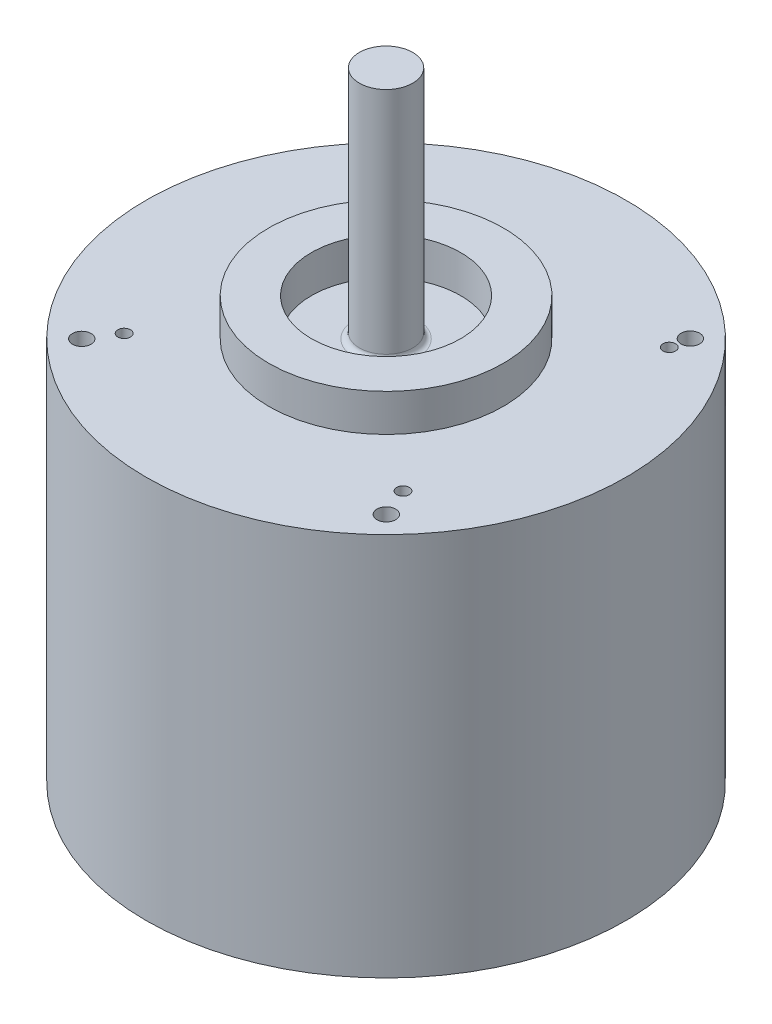
ISO-10303-21;
HEADER;
FILE_DESCRIPTION(('STEP AP214'),'2;1');
FILE_NAME('part.step','',(''),(''),'','','');
FILE_SCHEMA(('AUTOMOTIVE_DESIGN { 1 0 10303 214 1 1 1 1 }'));
ENDSEC;
DATA;
#1=APPLICATION_CONTEXT('core data for automotive mechanical design processes');
#2=APPLICATION_PROTOCOL_DEFINITION('international standard','automotive_design',2000,#1);
#3=PRODUCT_CONTEXT('',#1,'mechanical');
#4=PRODUCT('Part','Part','',(#3));
#5=PRODUCT_RELATED_PRODUCT_CATEGORY('part','',(#4));
#6=PRODUCT_DEFINITION_FORMATION('','',#4);
#7=PRODUCT_DEFINITION_CONTEXT('part definition',#1,'design');
#8=PRODUCT_DEFINITION('design','',#6,#7);
#9=PRODUCT_DEFINITION_SHAPE('','',#8);
#10=(LENGTH_UNIT() NAMED_UNIT(*) SI_UNIT(.MILLI.,.METRE.));
#11=(NAMED_UNIT(*) PLANE_ANGLE_UNIT() SI_UNIT($,.RADIAN.));
#12=(NAMED_UNIT(*) SI_UNIT($,.STERADIAN.) SOLID_ANGLE_UNIT());
#13=UNCERTAINTY_MEASURE_WITH_UNIT(LENGTH_MEASURE(1.E-05),#10,'distance_accuracy_value','');
#14=(GEOMETRIC_REPRESENTATION_CONTEXT(3) GLOBAL_UNCERTAINTY_ASSIGNED_CONTEXT((#13)) GLOBAL_UNIT_ASSIGNED_CONTEXT((#10,
#11,#12)) REPRESENTATION_CONTEXT('',''));
#15=CARTESIAN_POINT('',(0.,0.,0.));
#16=DIRECTION('',(0.,0.,1.));
#17=DIRECTION('',(1.,0.,0.));
#18=AXIS2_PLACEMENT_3D('',#15,#16,#17);
#19=CARTESIAN_POINT('',(0.,0.,0.));
#20=DIRECTION('',(0.,1.,0.));
#21=DIRECTION('',(0.,0.,1.));
#22=AXIS2_PLACEMENT_3D('',#19,#20,#21);
#23=PLANE('',#22);
#24=CARTESIAN_POINT('',(0.,0.,-11.5));
#25=DIRECTION('',(0.,1.,0.));
#26=DIRECTION('',(0.,0.,1.));
#27=AXIS2_PLACEMENT_3D('',#24,#25,#26);
#28=CIRCLE('',#27,2.5);
#29=CARTESIAN_POINT('',(0.,0.,-9.));
#30=VERTEX_POINT('',#29);
#31=EDGE_CURVE('E304',#30,#30,#28,.T.);
#32=ORIENTED_EDGE('',*,*,#31,.T.);
#33=EDGE_LOOP('',(#32));
#34=FACE_BOUND('',#33,.T.);
#35=CARTESIAN_POINT('',(0.,0.,0.));
#36=DIRECTION('',(0.,1.,0.));
#37=DIRECTION('',(0.,0.,1.));
#38=AXIS2_PLACEMENT_3D('',#35,#36,#37);
#39=CIRCLE('',#38,22.5);
#40=CARTESIAN_POINT('',(0.,0.,22.5));
#41=VERTEX_POINT('',#40);
#42=EDGE_CURVE('E143',#41,#41,#39,.T.);
#43=ORIENTED_EDGE('',*,*,#42,.F.);
#44=EDGE_LOOP('',(#43));
#45=FACE_BOUND('',#44,.T.);
#46=ADVANCED_FACE('F35',(#34,#45),#23,.F.);
#47=CARTESIAN_POINT('',(0.,36.,0.));
#48=DIRECTION('',(0.,1.,0.));
#49=DIRECTION('',(0.,0.,1.));
#50=AXIS2_PLACEMENT_3D('',#47,#48,#49);
#51=PLANE('',#50);
#52=CARTESIAN_POINT('',(0.,36.,0.));
#53=DIRECTION('',(0.,1.,0.));
#54=DIRECTION('',(0.,0.,1.));
#55=AXIS2_PLACEMENT_3D('',#52,#53,#54);
#56=CIRCLE('',#55,3.);
#57=CARTESIAN_POINT('',(0.,36.,3.));
#58=VERTEX_POINT('',#57);
#59=EDGE_CURVE('E43',#58,#58,#56,.F.);
#60=ORIENTED_EDGE('',*,*,#59,.T.);
#61=EDGE_LOOP('',(#60));
#62=FACE_BOUND('',#61,.T.);
#63=CARTESIAN_POINT('',(0.,36.,0.));
#64=DIRECTION('',(0.,1.,0.));
#65=DIRECTION('',(0.,0.,1.));
#66=AXIS2_PLACEMENT_3D('',#63,#64,#65);
#67=CIRCLE('',#66,7.);
#68=CARTESIAN_POINT('',(0.,36.,7.));
#69=VERTEX_POINT('',#68);
#70=EDGE_CURVE('E134',#69,#69,#67,.T.);
#71=ORIENTED_EDGE('',*,*,#70,.T.);
#72=EDGE_LOOP('',(#71));
#73=FACE_BOUND('',#72,.T.);
#74=ADVANCED_FACE('F156',(#62,#73),#51,.T.);
#75=CARTESIAN_POINT('',(0.,36.,0.));
#76=DIRECTION('',(0.,1.,0.));
#77=DIRECTION('',(0.,0.,1.));
#78=AXIS2_PLACEMENT_3D('',#75,#76,#77);
#79=PLANE('',#78);
#80=CARTESIAN_POINT('',(-13.163543755973,36.,-12.0287555011478));
#81=DIRECTION('',(0.,1.,0.));
#82=DIRECTION('',(0.,0.,1.));
#83=AXIS2_PLACEMENT_3D('',#80,#81,#82);
#84=CIRCLE('',#83,0.595629999999989);
#85=CARTESIAN_POINT('',(-13.163543755973,36.,-11.4331255011478));
#86=VERTEX_POINT('',#85);
#87=EDGE_CURVE('E79',#86,#86,#84,.T.);
#88=ORIENTED_EDGE('',*,*,#87,.F.);
#89=EDGE_LOOP('',(#88));
#90=FACE_BOUND('',#89,.T.);
#91=CARTESIAN_POINT('',(13.163543755973,36.,11.5748401992176));
#92=DIRECTION('',(0.,1.,0.));
#93=DIRECTION('',(0.,0.,1.));
#94=AXIS2_PLACEMENT_3D('',#91,#92,#93);
#95=CIRCLE('',#94,0.595629999999989);
#96=CARTESIAN_POINT('',(13.163543755973,36.,12.1704701992176));
#97=VERTEX_POINT('',#96);
#98=EDGE_CURVE('E78',#97,#97,#95,.T.);
#99=ORIENTED_EDGE('',*,*,#98,.F.);
#100=EDGE_LOOP('',(#99));
#101=FACE_BOUND('',#100,.T.);
#102=CARTESIAN_POINT('',(13.9805912994472,36.,-12.5734538634639));
#103=DIRECTION('',(0.,1.,0.));
#104=DIRECTION('',(0.,0.,1.));
#105=AXIS2_PLACEMENT_3D('',#102,#103,#104);
#106=CIRCLE('',#105,0.595629999999989);
#107=CARTESIAN_POINT('',(13.9805912994472,36.,-11.9778238634639));
#108=VERTEX_POINT('',#107);
#109=EDGE_CURVE('E91',#108,#108,#106,.T.);
#110=ORIENTED_EDGE('',*,*,#109,.F.);
#111=EDGE_LOOP('',(#110));
#112=FACE_BOUND('',#111,.T.);
#113=CARTESIAN_POINT('',(-12.7096284540429,36.,11.8471893803757));
#114=DIRECTION('',(0.,1.,0.));
#115=DIRECTION('',(0.,0.,1.));
#116=AXIS2_PLACEMENT_3D('',#113,#114,#115);
#117=CIRCLE('',#116,0.595629999999989);
#118=CARTESIAN_POINT('',(-12.7096284540429,36.,12.4428193803756));
#119=VERTEX_POINT('',#118);
#120=EDGE_CURVE('E97',#119,#119,#117,.T.);
#121=ORIENTED_EDGE('',*,*,#120,.F.);
#122=EDGE_LOOP('',(#121));
#123=FACE_BOUND('',#122,.T.);
#124=CARTESIAN_POINT('',(-14.2766530159782,36.,-14.2534216308251));
#125=DIRECTION('',(0.,1.,0.));
#126=DIRECTION('',(0.,0.,1.));
#127=AXIS2_PLACEMENT_3D('',#124,#125,#126);
#128=CIRCLE('',#127,0.874999999999989);
#129=CARTESIAN_POINT('',(-14.2766530159782,36.,-13.3784216308251));
#130=VERTEX_POINT('',#129);
#131=EDGE_CURVE('E106',#130,#130,#128,.T.);
#132=ORIENTED_EDGE('',*,*,#131,.F.);
#133=EDGE_LOOP('',(#132));
#134=FACE_BOUND('',#133,.T.);
#135=CARTESIAN_POINT('',(14.2534216308251,36.,-14.2766530159782));
#136=DIRECTION('',(0.,1.,0.));
#137=DIRECTION('',(0.,0.,1.));
#138=AXIS2_PLACEMENT_3D('',#135,#136,#137);
#139=CIRCLE('',#138,0.874999999999989);
#140=CARTESIAN_POINT('',(14.2534216308251,36.,-13.4016530159782));
#141=VERTEX_POINT('',#140);
#142=EDGE_CURVE('E112',#141,#141,#139,.T.);
#143=ORIENTED_EDGE('',*,*,#142,.F.);
#144=EDGE_LOOP('',(#143));
#145=FACE_BOUND('',#144,.T.);
#146=CARTESIAN_POINT('',(-14.2534216308251,36.,14.2766530159782));
#147=DIRECTION('',(0.,1.,0.));
#148=DIRECTION('',(0.,0.,1.));
#149=AXIS2_PLACEMENT_3D('',#146,#147,#148);
#150=CIRCLE('',#149,0.874999999999989);
#151=CARTESIAN_POINT('',(-14.2534216308251,36.,15.1516530159782));
#152=VERTEX_POINT('',#151);
#153=EDGE_CURVE('E118',#152,#152,#150,.T.);
#154=ORIENTED_EDGE('',*,*,#153,.F.);
#155=EDGE_LOOP('',(#154));
#156=FACE_BOUND('',#155,.T.);
#157=CARTESIAN_POINT('',(14.2766530159782,36.,14.2534216308251));
#158=DIRECTION('',(0.,1.,0.));
#159=DIRECTION('',(0.,0.,1.));
#160=AXIS2_PLACEMENT_3D('',#157,#158,#159);
#161=CIRCLE('',#160,0.874999999999989);
#162=CARTESIAN_POINT('',(14.2766530159782,36.,15.1284216308251));
#163=VERTEX_POINT('',#162);
#164=EDGE_CURVE('E124',#163,#163,#161,.T.);
#165=ORIENTED_EDGE('',*,*,#164,.F.);
#166=EDGE_LOOP('',(#165));
#167=FACE_BOUND('',#166,.T.);
#168=CARTESIAN_POINT('',(0.,36.,0.));
#169=DIRECTION('',(0.,1.,0.));
#170=DIRECTION('',(0.,0.,1.));
#171=AXIS2_PLACEMENT_3D('',#168,#169,#170);
#172=CIRCLE('',#171,22.5);
#173=CARTESIAN_POINT('',(0.,36.,22.5));
#174=VERTEX_POINT('',#173);
#175=EDGE_CURVE('E146',#174,#174,#172,.T.);
#176=ORIENTED_EDGE('',*,*,#175,.T.);
#177=EDGE_LOOP('',(#176));
#178=FACE_BOUND('',#177,.T.);
#179=CARTESIAN_POINT('',(0.,36.,0.));
#180=DIRECTION('',(0.,1.,0.));
#181=DIRECTION('',(0.,0.,1.));
#182=AXIS2_PLACEMENT_3D('',#179,#180,#181);
#183=CIRCLE('',#182,11.);
#184=CARTESIAN_POINT('',(0.,36.,11.));
#185=VERTEX_POINT('',#184);
#186=EDGE_CURVE('E137',#185,#185,#183,.T.);
#187=ORIENTED_EDGE('',*,*,#186,.F.);
#188=EDGE_LOOP('',(#187));
#189=FACE_BOUND('',#188,.T.);
#190=ADVANCED_FACE('F183',(#90,#101,#112,#123,#134,#145,#156,#167,#178,#189),#79,.T.);
#191=CARTESIAN_POINT('',(0.,36.,0.));
#192=DIRECTION('',(0.,-1.,0.));
#193=DIRECTION('',(0.,0.,-1.));
#194=AXIS2_PLACEMENT_3D('',#191,#192,#193);
#195=CYLINDRICAL_SURFACE('',#194,22.5);
#196=ORIENTED_EDGE('',*,*,#175,.F.);
#197=EDGE_LOOP('',(#196));
#198=FACE_BOUND('',#197,.T.);
#199=ORIENTED_EDGE('',*,*,#42,.T.);
#200=EDGE_LOOP('',(#199));
#201=FACE_BOUND('',#200,.T.);
#202=ADVANCED_FACE('F189',(#198,#201),#195,.T.);
#203=CARTESIAN_POINT('',(0.,39.5,0.));
#204=DIRECTION('',(0.,-1.,0.));
#205=DIRECTION('',(0.,0.,-1.));
#206=AXIS2_PLACEMENT_3D('',#203,#204,#205);
#207=CYLINDRICAL_SURFACE('',#206,11.);
#208=CARTESIAN_POINT('',(0.,39.5,0.));
#209=DIRECTION('',(0.,1.,0.));
#210=DIRECTION('',(0.,0.,1.));
#211=AXIS2_PLACEMENT_3D('',#208,#209,#210);
#212=CIRCLE('',#211,11.);
#213=CARTESIAN_POINT('',(0.,39.5,11.));
#214=VERTEX_POINT('',#213);
#215=EDGE_CURVE('E140',#214,#214,#212,.T.);
#216=ORIENTED_EDGE('',*,*,#215,.F.);
#217=EDGE_LOOP('',(#216));
#218=FACE_BOUND('',#217,.T.);
#219=ORIENTED_EDGE('',*,*,#186,.T.);
#220=EDGE_LOOP('',(#219));
#221=FACE_BOUND('',#220,.T.);
#222=ADVANCED_FACE('F191',(#218,#221),#207,.T.);
#223=CARTESIAN_POINT('',(0.,39.5,0.));
#224=DIRECTION('',(0.,1.,0.));
#225=DIRECTION('',(0.,0.,1.));
#226=AXIS2_PLACEMENT_3D('',#223,#224,#225);
#227=PLANE('',#226);
#228=CARTESIAN_POINT('',(0.,39.5,0.));
#229=DIRECTION('',(0.,1.,0.));
#230=DIRECTION('',(0.,0.,1.));
#231=AXIS2_PLACEMENT_3D('',#228,#229,#230);
#232=CIRCLE('',#231,7.);
#233=CARTESIAN_POINT('',(0.,39.5,7.));
#234=VERTEX_POINT('',#233);
#235=EDGE_CURVE('E133',#234,#234,#232,.T.);
#236=ORIENTED_EDGE('',*,*,#235,.F.);
#237=EDGE_LOOP('',(#236));
#238=FACE_BOUND('',#237,.T.);
#239=ORIENTED_EDGE('',*,*,#215,.T.);
#240=EDGE_LOOP('',(#239));
#241=FACE_BOUND('',#240,.T.);
#242=ADVANCED_FACE('F197',(#238,#241),#227,.T.);
#243=CARTESIAN_POINT('',(0.,36.,0.));
#244=DIRECTION('',(0.,1.,0.));
#245=DIRECTION('',(0.,0.,1.));
#246=AXIS2_PLACEMENT_3D('',#243,#244,#245);
#247=CYLINDRICAL_SURFACE('',#246,7.);
#248=ORIENTED_EDGE('',*,*,#70,.F.);
#249=EDGE_LOOP('',(#248));
#250=FACE_BOUND('',#249,.T.);
#251=ORIENTED_EDGE('',*,*,#235,.T.);
#252=EDGE_LOOP('',(#251));
#253=FACE_BOUND('',#252,.T.);
#254=ADVANCED_FACE('F168',(#250,#253),#247,.F.);
#255=CARTESIAN_POINT('',(0.,58.,0.));
#256=DIRECTION('',(0.,-1.,0.));
#257=DIRECTION('',(0.,0.,-1.));
#258=AXIS2_PLACEMENT_3D('',#255,#256,#257);
#259=CYLINDRICAL_SURFACE('',#258,2.5);
#260=CARTESIAN_POINT('',(0.,36.5,0.));
#261=DIRECTION('',(0.,1.,0.));
#262=DIRECTION('',(0.,0.,1.));
#263=AXIS2_PLACEMENT_3D('',#260,#261,#262);
#264=CIRCLE('',#263,2.5);
#265=CARTESIAN_POINT('',(0.,36.5,2.5));
#266=VERTEX_POINT('',#265);
#267=EDGE_CURVE('E149',#266,#266,#264,.T.);
#268=ORIENTED_EDGE('',*,*,#267,.T.);
#269=EDGE_LOOP('',(#268));
#270=FACE_BOUND('',#269,.T.);
#271=CARTESIAN_POINT('',(0.,58.,0.));
#272=DIRECTION('',(0.,1.,0.));
#273=DIRECTION('',(0.,0.,1.));
#274=AXIS2_PLACEMENT_3D('',#271,#272,#273);
#275=CIRCLE('',#274,2.5);
#276=CARTESIAN_POINT('',(0.,58.,2.5));
#277=VERTEX_POINT('',#276);
#278=EDGE_CURVE('E130',#277,#277,#275,.T.);
#279=ORIENTED_EDGE('',*,*,#278,.F.);
#280=EDGE_LOOP('',(#279));
#281=FACE_BOUND('',#280,.T.);
#282=ADVANCED_FACE('F165',(#270,#281),#259,.T.);
#283=CARTESIAN_POINT('',(0.,58.,0.));
#284=DIRECTION('',(0.,1.,0.));
#285=DIRECTION('',(0.,0.,1.));
#286=AXIS2_PLACEMENT_3D('',#283,#284,#285);
#287=PLANE('',#286);
#288=ORIENTED_EDGE('',*,*,#278,.T.);
#289=EDGE_LOOP('',(#288));
#290=FACE_BOUND('',#289,.T.);
#291=ADVANCED_FACE('F162',(#290),#287,.T.);
#292=CARTESIAN_POINT('',(0.,36.5,0.));
#293=DIRECTION('',(0.,1.,0.));
#294=DIRECTION('',(0.,0.,1.));
#295=AXIS2_PLACEMENT_3D('',#292,#293,#294);
#296=TOROIDAL_SURFACE('',#295,3.,0.5);
#297=ORIENTED_EDGE('',*,*,#59,.F.);
#298=EDGE_LOOP('',(#297));
#299=FACE_BOUND('',#298,.T.);
#300=ORIENTED_EDGE('',*,*,#267,.F.);
#301=EDGE_LOOP('',(#300));
#302=FACE_BOUND('',#301,.T.);
#303=ADVANCED_FACE('F37',(#299,#302),#296,.F.);
#304=CARTESIAN_POINT('',(14.2766530159782,30.25,14.2534216308251));
#305=DIRECTION('',(0.,1.,0.));
#306=DIRECTION('',(0.,0.,1.));
#307=AXIS2_PLACEMENT_3D('',#304,#305,#306);
#308=CONICAL_SURFACE('',#307,0.874999999999987,1.02974425867665);
#309=CARTESIAN_POINT('',(14.2766530159782,29.7242469583509,14.2534216308251));
#310=VERTEX_POINT('',#309);
#311=VERTEX_LOOP('',#310);
#312=FACE_BOUND('',#311,.T.);
#313=CARTESIAN_POINT('',(14.2766530159782,30.25,14.2534216308251));
#314=DIRECTION('',(0.,1.,0.));
#315=DIRECTION('',(0.,0.,1.));
#316=AXIS2_PLACEMENT_3D('',#313,#314,#315);
#317=CIRCLE('',#316,0.874999999999987);
#318=CARTESIAN_POINT('',(14.2766530159782,30.25,15.1284216308251));
#319=VERTEX_POINT('',#318);
#320=EDGE_CURVE('E127',#319,#319,#317,.T.);
#321=ORIENTED_EDGE('',*,*,#320,.T.);
#322=EDGE_LOOP('',(#321));
#323=FACE_BOUND('',#322,.T.);
#324=ADVANCED_FACE('F161',(#312,#323),#308,.F.);
#325=CARTESIAN_POINT('',(14.2766530159782,36.,14.2534216308251));
#326=DIRECTION('',(0.,1.,0.));
#327=DIRECTION('',(0.,0.,1.));
#328=AXIS2_PLACEMENT_3D('',#325,#326,#327);
#329=CYLINDRICAL_SURFACE('',#328,0.874999999999988);
#330=ORIENTED_EDGE('',*,*,#320,.F.);
#331=EDGE_LOOP('',(#330));
#332=FACE_BOUND('',#331,.T.);
#333=ORIENTED_EDGE('',*,*,#164,.T.);
#334=EDGE_LOOP('',(#333));
#335=FACE_BOUND('',#334,.T.);
#336=ADVANCED_FACE('F225',(#332,#335),#329,.F.);
#337=CARTESIAN_POINT('',(-14.2534216308251,30.25,14.2766530159782));
#338=DIRECTION('',(0.,1.,0.));
#339=DIRECTION('',(0.,0.,1.));
#340=AXIS2_PLACEMENT_3D('',#337,#338,#339);
#341=CONICAL_SURFACE('',#340,0.874999999999987,1.02974425867665);
#342=CARTESIAN_POINT('',(-14.2534216308251,29.7242469583509,14.2766530159782));
#343=VERTEX_POINT('',#342);
#344=VERTEX_LOOP('',#343);
#345=FACE_BOUND('',#344,.T.);
#346=CARTESIAN_POINT('',(-14.2534216308251,30.25,14.2766530159782));
#347=DIRECTION('',(0.,1.,0.));
#348=DIRECTION('',(0.,0.,1.));
#349=AXIS2_PLACEMENT_3D('',#346,#347,#348);
#350=CIRCLE('',#349,0.874999999999987);
#351=CARTESIAN_POINT('',(-14.2534216308251,30.25,15.1516530159782));
#352=VERTEX_POINT('',#351);
#353=EDGE_CURVE('E121',#352,#352,#350,.T.);
#354=ORIENTED_EDGE('',*,*,#353,.T.);
#355=EDGE_LOOP('',(#354));
#356=FACE_BOUND('',#355,.T.);
#357=ADVANCED_FACE('F227',(#345,#356),#341,.F.);
#358=CARTESIAN_POINT('',(-14.2534216308251,36.,14.2766530159782));
#359=DIRECTION('',(0.,1.,0.));
#360=DIRECTION('',(0.,0.,1.));
#361=AXIS2_PLACEMENT_3D('',#358,#359,#360);
#362=CYLINDRICAL_SURFACE('',#361,0.874999999999988);
#363=ORIENTED_EDGE('',*,*,#353,.F.);
#364=EDGE_LOOP('',(#363));
#365=FACE_BOUND('',#364,.T.);
#366=ORIENTED_EDGE('',*,*,#153,.T.);
#367=EDGE_LOOP('',(#366));
#368=FACE_BOUND('',#367,.T.);
#369=ADVANCED_FACE('F234',(#365,#368),#362,.F.);
#370=CARTESIAN_POINT('',(14.2534216308251,30.25,-14.2766530159782));
#371=DIRECTION('',(0.,1.,0.));
#372=DIRECTION('',(0.,0.,1.));
#373=AXIS2_PLACEMENT_3D('',#370,#371,#372);
#374=CONICAL_SURFACE('',#373,0.874999999999987,1.02974425867665);
#375=CARTESIAN_POINT('',(14.2534216308251,29.7242469583509,-14.2766530159782));
#376=VERTEX_POINT('',#375);
#377=VERTEX_LOOP('',#376);
#378=FACE_BOUND('',#377,.T.);
#379=CARTESIAN_POINT('',(14.2534216308251,30.25,-14.2766530159782));
#380=DIRECTION('',(0.,1.,0.));
#381=DIRECTION('',(0.,0.,1.));
#382=AXIS2_PLACEMENT_3D('',#379,#380,#381);
#383=CIRCLE('',#382,0.874999999999987);
#384=CARTESIAN_POINT('',(14.2534216308251,30.25,-13.4016530159782));
#385=VERTEX_POINT('',#384);
#386=EDGE_CURVE('E115',#385,#385,#383,.T.);
#387=ORIENTED_EDGE('',*,*,#386,.T.);
#388=EDGE_LOOP('',(#387));
#389=FACE_BOUND('',#388,.T.);
#390=ADVANCED_FACE('F240',(#378,#389),#374,.F.);
#391=CARTESIAN_POINT('',(14.2534216308251,36.,-14.2766530159782));
#392=DIRECTION('',(0.,1.,0.));
#393=DIRECTION('',(0.,0.,1.));
#394=AXIS2_PLACEMENT_3D('',#391,#392,#393);
#395=CYLINDRICAL_SURFACE('',#394,0.874999999999988);
#396=ORIENTED_EDGE('',*,*,#386,.F.);
#397=EDGE_LOOP('',(#396));
#398=FACE_BOUND('',#397,.T.);
#399=ORIENTED_EDGE('',*,*,#142,.T.);
#400=EDGE_LOOP('',(#399));
#401=FACE_BOUND('',#400,.T.);
#402=ADVANCED_FACE('F244',(#398,#401),#395,.F.);
#403=CARTESIAN_POINT('',(-14.2766530159782,30.25,-14.2534216308251));
#404=DIRECTION('',(0.,1.,0.));
#405=DIRECTION('',(0.,0.,1.));
#406=AXIS2_PLACEMENT_3D('',#403,#404,#405);
#407=CONICAL_SURFACE('',#406,0.874999999999987,1.02974425867665);
#408=CARTESIAN_POINT('',(-14.2766530159782,29.7242469583509,-14.2534216308251));
#409=VERTEX_POINT('',#408);
#410=VERTEX_LOOP('',#409);
#411=FACE_BOUND('',#410,.T.);
#412=CARTESIAN_POINT('',(-14.2766530159782,30.25,-14.2534216308251));
#413=DIRECTION('',(0.,1.,0.));
#414=DIRECTION('',(0.,0.,1.));
#415=AXIS2_PLACEMENT_3D('',#412,#413,#414);
#416=CIRCLE('',#415,0.874999999999987);
#417=CARTESIAN_POINT('',(-14.2766530159782,30.25,-13.3784216308251));
#418=VERTEX_POINT('',#417);
#419=EDGE_CURVE('E109',#418,#418,#416,.T.);
#420=ORIENTED_EDGE('',*,*,#419,.T.);
#421=EDGE_LOOP('',(#420));
#422=FACE_BOUND('',#421,.T.);
#423=ADVANCED_FACE('F248',(#411,#422),#407,.F.);
#424=CARTESIAN_POINT('',(-14.2766530159782,36.,-14.2534216308251));
#425=DIRECTION('',(0.,1.,0.));
#426=DIRECTION('',(0.,0.,1.));
#427=AXIS2_PLACEMENT_3D('',#424,#425,#426);
#428=CYLINDRICAL_SURFACE('',#427,0.874999999999988);
#429=ORIENTED_EDGE('',*,*,#419,.F.);
#430=EDGE_LOOP('',(#429));
#431=FACE_BOUND('',#430,.T.);
#432=ORIENTED_EDGE('',*,*,#131,.T.);
#433=EDGE_LOOP('',(#432));
#434=FACE_BOUND('',#433,.T.);
#435=ADVANCED_FACE('F252',(#431,#434),#428,.F.);
#436=CARTESIAN_POINT('',(-12.7096284540429,26.,11.8471893803757));
#437=DIRECTION('',(0.,1.,0.));
#438=DIRECTION('',(0.,0.,1.));
#439=AXIS2_PLACEMENT_3D('',#436,#437,#438);
#440=CONICAL_SURFACE('',#439,0.595629999999998,1.02974425867665);
#441=CARTESIAN_POINT('',(-12.7096284540429,25.6421093894886,11.8471893803757));
#442=VERTEX_POINT('',#441);
#443=VERTEX_LOOP('',#442);
#444=FACE_BOUND('',#443,.T.);
#445=CARTESIAN_POINT('',(-12.7096284540429,26.,11.8471893803757));
#446=DIRECTION('',(0.,1.,0.));
#447=DIRECTION('',(0.,0.,1.));
#448=AXIS2_PLACEMENT_3D('',#445,#446,#447);
#449=CIRCLE('',#448,0.595629999999998);
#450=CARTESIAN_POINT('',(-12.7096284540429,26.,12.4428193803757));
#451=VERTEX_POINT('',#450);
#452=EDGE_CURVE('E100',#451,#451,#449,.T.);
#453=ORIENTED_EDGE('',*,*,#452,.T.);
#454=EDGE_LOOP('',(#453));
#455=FACE_BOUND('',#454,.T.);
#456=ADVANCED_FACE('F256',(#444,#455),#440,.F.);
#457=CARTESIAN_POINT('',(-12.7096284540429,36.,11.8471893803757));
#458=DIRECTION('',(0.,1.,0.));
#459=DIRECTION('',(0.,0.,1.));
#460=AXIS2_PLACEMENT_3D('',#457,#458,#459);
#461=CYLINDRICAL_SURFACE('',#460,0.595629999999994);
#462=ORIENTED_EDGE('',*,*,#452,.F.);
#463=EDGE_LOOP('',(#462));
#464=FACE_BOUND('',#463,.T.);
#465=ORIENTED_EDGE('',*,*,#120,.T.);
#466=EDGE_LOOP('',(#465));
#467=FACE_BOUND('',#466,.T.);
#468=ADVANCED_FACE('F269',(#464,#467),#461,.F.);
#469=CARTESIAN_POINT('',(13.9805912994472,26.,-12.5734538634639));
#470=DIRECTION('',(0.,1.,0.));
#471=DIRECTION('',(0.,0.,1.));
#472=AXIS2_PLACEMENT_3D('',#469,#470,#471);
#473=CONICAL_SURFACE('',#472,0.595629999999998,1.02974425867665);
#474=CARTESIAN_POINT('',(13.9805912994472,25.6421093894886,-12.5734538634639));
#475=VERTEX_POINT('',#474);
#476=VERTEX_LOOP('',#475);
#477=FACE_BOUND('',#476,.T.);
#478=CARTESIAN_POINT('',(13.9805912994472,26.,-12.5734538634639));
#479=DIRECTION('',(0.,1.,0.));
#480=DIRECTION('',(0.,0.,1.));
#481=AXIS2_PLACEMENT_3D('',#478,#479,#480);
#482=CIRCLE('',#481,0.595629999999998);
#483=CARTESIAN_POINT('',(13.9805912994472,26.,-11.9778238634639));
#484=VERTEX_POINT('',#483);
#485=EDGE_CURVE('E94',#484,#484,#482,.T.);
#486=ORIENTED_EDGE('',*,*,#485,.T.);
#487=EDGE_LOOP('',(#486));
#488=FACE_BOUND('',#487,.T.);
#489=ADVANCED_FACE('F273',(#477,#488),#473,.F.);
#490=CARTESIAN_POINT('',(13.9805912994472,36.,-12.5734538634639));
#491=DIRECTION('',(0.,1.,0.));
#492=DIRECTION('',(0.,0.,1.));
#493=AXIS2_PLACEMENT_3D('',#490,#491,#492);
#494=CYLINDRICAL_SURFACE('',#493,0.595629999999994);
#495=ORIENTED_EDGE('',*,*,#485,.F.);
#496=EDGE_LOOP('',(#495));
#497=FACE_BOUND('',#496,.T.);
#498=ORIENTED_EDGE('',*,*,#109,.T.);
#499=EDGE_LOOP('',(#498));
#500=FACE_BOUND('',#499,.T.);
#501=ADVANCED_FACE('F277',(#497,#500),#494,.F.);
#502=CARTESIAN_POINT('',(13.163543755973,26.,11.5748401992176));
#503=DIRECTION('',(0.,1.,0.));
#504=DIRECTION('',(0.,0.,1.));
#505=AXIS2_PLACEMENT_3D('',#502,#503,#504);
#506=CONICAL_SURFACE('',#505,0.595629999999998,1.02974425867665);
#507=CARTESIAN_POINT('',(13.163543755973,25.6421093894886,11.5748401992176));
#508=VERTEX_POINT('',#507);
#509=VERTEX_LOOP('',#508);
#510=FACE_BOUND('',#509,.T.);
#511=CARTESIAN_POINT('',(13.163543755973,26.,11.5748401992176));
#512=DIRECTION('',(0.,1.,0.));
#513=DIRECTION('',(0.,0.,1.));
#514=AXIS2_PLACEMENT_3D('',#511,#512,#513);
#515=CIRCLE('',#514,0.595629999999998);
#516=CARTESIAN_POINT('',(13.163543755973,26.,12.1704701992176));
#517=VERTEX_POINT('',#516);
#518=EDGE_CURVE('E82',#517,#517,#515,.T.);
#519=ORIENTED_EDGE('',*,*,#518,.T.);
#520=EDGE_LOOP('',(#519));
#521=FACE_BOUND('',#520,.T.);
#522=ADVANCED_FACE('F281',(#510,#521),#506,.F.);
#523=CARTESIAN_POINT('',(13.163543755973,36.,11.5748401992176));
#524=DIRECTION('',(0.,1.,0.));
#525=DIRECTION('',(0.,0.,1.));
#526=AXIS2_PLACEMENT_3D('',#523,#524,#525);
#527=CYLINDRICAL_SURFACE('',#526,0.595629999999994);
#528=ORIENTED_EDGE('',*,*,#518,.F.);
#529=EDGE_LOOP('',(#528));
#530=FACE_BOUND('',#529,.T.);
#531=ORIENTED_EDGE('',*,*,#98,.T.);
#532=EDGE_LOOP('',(#531));
#533=FACE_BOUND('',#532,.T.);
#534=ADVANCED_FACE('F72',(#530,#533),#527,.F.);
#535=CARTESIAN_POINT('',(-13.163543755973,26.,-12.0287555011478));
#536=DIRECTION('',(0.,1.,0.));
#537=DIRECTION('',(0.,0.,1.));
#538=AXIS2_PLACEMENT_3D('',#535,#536,#537);
#539=CONICAL_SURFACE('',#538,0.595629999999998,1.02974425867665);
#540=CARTESIAN_POINT('',(-13.163543755973,25.6421093894886,-12.0287555011478));
#541=VERTEX_POINT('',#540);
#542=VERTEX_LOOP('',#541);
#543=FACE_BOUND('',#542,.T.);
#544=CARTESIAN_POINT('',(-13.163543755973,26.,-12.0287555011478));
#545=DIRECTION('',(0.,1.,0.));
#546=DIRECTION('',(0.,0.,1.));
#547=AXIS2_PLACEMENT_3D('',#544,#545,#546);
#548=CIRCLE('',#547,0.595629999999998);
#549=CARTESIAN_POINT('',(-13.163543755973,26.,-11.4331255011478));
#550=VERTEX_POINT('',#549);
#551=EDGE_CURVE('E76',#550,#550,#548,.T.);
#552=ORIENTED_EDGE('',*,*,#551,.T.);
#553=EDGE_LOOP('',(#552));
#554=FACE_BOUND('',#553,.T.);
#555=ADVANCED_FACE('F68',(#543,#554),#539,.F.);
#556=CARTESIAN_POINT('',(-13.163543755973,36.,-12.0287555011478));
#557=DIRECTION('',(0.,1.,0.));
#558=DIRECTION('',(0.,0.,1.));
#559=AXIS2_PLACEMENT_3D('',#556,#557,#558);
#560=CYLINDRICAL_SURFACE('',#559,0.595629999999994);
#561=ORIENTED_EDGE('',*,*,#551,.F.);
#562=EDGE_LOOP('',(#561));
#563=FACE_BOUND('',#562,.T.);
#564=ORIENTED_EDGE('',*,*,#87,.T.);
#565=EDGE_LOOP('',(#564));
#566=FACE_BOUND('',#565,.T.);
#567=ADVANCED_FACE('F71',(#563,#566),#560,.F.);
#568=CARTESIAN_POINT('',(0.,-6.,-11.5));
#569=DIRECTION('',(0.,1.,0.));
#570=DIRECTION('',(0.,0.,1.));
#571=AXIS2_PLACEMENT_3D('',#568,#569,#570);
#572=PLANE('',#571);
#573=CARTESIAN_POINT('',(0.,-6.,-11.5));
#574=DIRECTION('',(0.,1.,0.));
#575=DIRECTION('',(0.,0.,1.));
#576=AXIS2_PLACEMENT_3D('',#573,#574,#575);
#577=CIRCLE('',#576,2.5);
#578=CARTESIAN_POINT('',(0.,-6.,-9.));
#579=VERTEX_POINT('',#578);
#580=EDGE_CURVE('E85',#579,#579,#577,.T.);
#581=ORIENTED_EDGE('',*,*,#580,.F.);
#582=EDGE_LOOP('',(#581));
#583=FACE_BOUND('',#582,.T.);
#584=CARTESIAN_POINT('',(0.,-6.,-11.5));
#585=DIRECTION('',(0.,1.,0.));
#586=DIRECTION('',(0.,0.,1.));
#587=AXIS2_PLACEMENT_3D('',#584,#585,#586);
#588=CIRCLE('',#587,2.49005549586152);
#589=CARTESIAN_POINT('',(0.,-6.,-9.00994450413848));
#590=VERTEX_POINT('',#589);
#591=EDGE_CURVE('E11',#590,#590,#588,.T.);
#592=ORIENTED_EDGE('',*,*,#591,.T.);
#593=EDGE_LOOP('',(#592));
#594=FACE_BOUND('',#593,.T.);
#595=ADVANCED_FACE('F291',(#583,#594),#572,.F.);
#596=CARTESIAN_POINT('',(0.,-6.,-11.5));
#597=DIRECTION('',(0.,1.,0.));
#598=DIRECTION('',(0.,0.,1.));
#599=AXIS2_PLACEMENT_3D('',#596,#597,#598);
#600=CYLINDRICAL_SURFACE('',#599,2.5);
#601=ORIENTED_EDGE('',*,*,#580,.T.);
#602=EDGE_LOOP('',(#601));
#603=FACE_BOUND('',#602,.T.);
#604=ORIENTED_EDGE('',*,*,#31,.F.);
#605=EDGE_LOOP('',(#604));
#606=FACE_BOUND('',#605,.T.);
#607=ADVANCED_FACE('F265',(#603,#606),#600,.T.);
#608=CARTESIAN_POINT('',(0.,-7.,-11.5));
#609=DIRECTION('',(0.,-1.,0.));
#610=DIRECTION('',(0.,0.,-1.));
#611=AXIS2_PLACEMENT_3D('',#608,#609,#610);
#612=PLANE('',#611);
#613=CARTESIAN_POINT('',(0.,-7.,-11.5));
#614=DIRECTION('',(0.,-1.,0.));
#615=DIRECTION('',(0.,0.,-1.));
#616=AXIS2_PLACEMENT_3D('',#613,#614,#615);
#617=CIRCLE('',#616,2.49005549586152);
#618=CARTESIAN_POINT('',(0.,-7.,-13.9900554958615));
#619=VERTEX_POINT('',#618);
#620=EDGE_CURVE('E103',#619,#619,#617,.T.);
#621=ORIENTED_EDGE('',*,*,#620,.T.);
#622=EDGE_LOOP('',(#621));
#623=FACE_BOUND('',#622,.T.);
#624=ADVANCED_FACE('F261',(#623),#612,.T.);
#625=CARTESIAN_POINT('',(0.,-7.,-11.5));
#626=DIRECTION('',(0.,1.,0.));
#627=DIRECTION('',(0.,0.,1.));
#628=AXIS2_PLACEMENT_3D('',#625,#626,#627);
#629=CYLINDRICAL_SURFACE('',#628,2.49005549586152);
#630=ORIENTED_EDGE('',*,*,#620,.F.);
#631=EDGE_LOOP('',(#630));
#632=FACE_BOUND('',#631,.T.);
#633=ORIENTED_EDGE('',*,*,#591,.F.);
#634=EDGE_LOOP('',(#633));
#635=FACE_BOUND('',#634,.T.);
#636=ADVANCED_FACE('F258',(#632,#635),#629,.T.);
#637=CLOSED_SHELL('',(#46,#74,#190,#202,#222,#242,#254,#282,#291,#303,#324,#336,#357,#369,#390,
#402,#423,#435,#456,#468,#489,#501,#522,#534,#555,#567,#595,#607,#624,#636));
#638=MANIFOLD_SOLID_BREP('B2',#637);
#639=ADVANCED_BREP_SHAPE_REPRESENTATION('',(#18,#638),#14);
#640=SHAPE_DEFINITION_REPRESENTATION(#9,#639);
ENDSEC;
END-ISO-10303-21;
